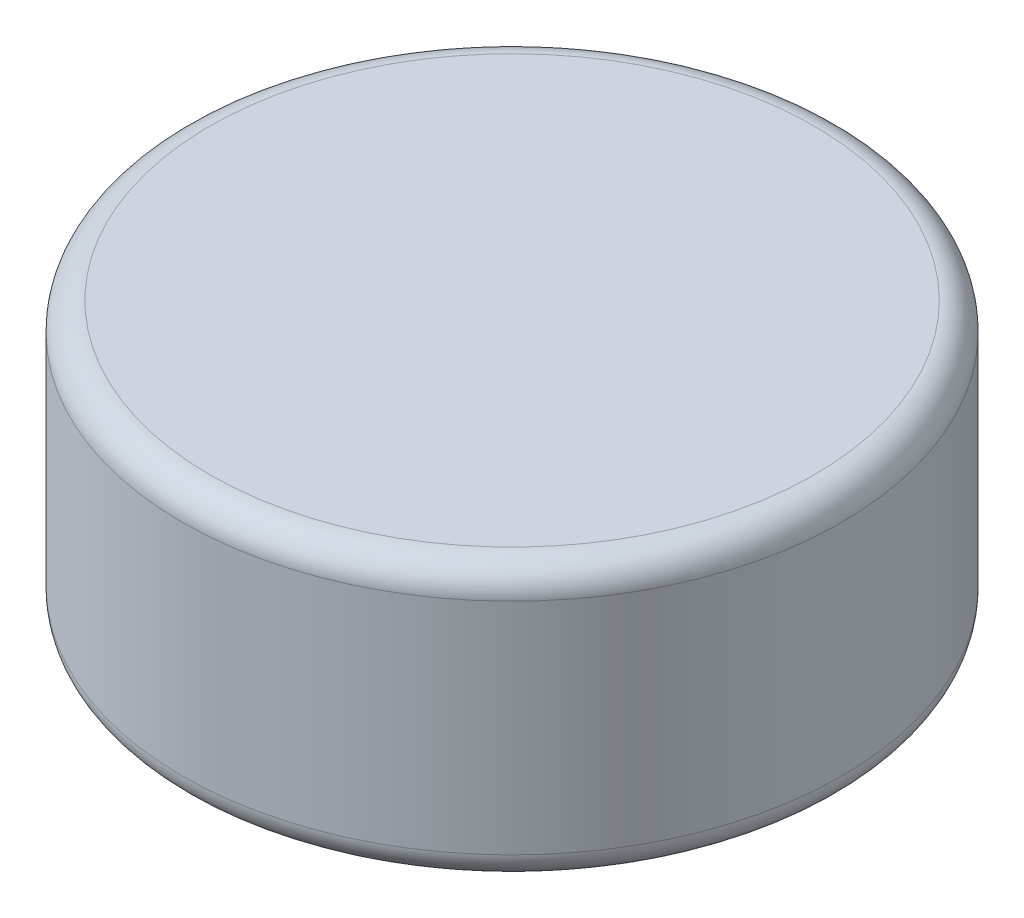
ISO-10303-21;
HEADER;
FILE_DESCRIPTION(('STEP AP214'),'2;1');
FILE_NAME('part.step','',(''),(''),'','','');
FILE_SCHEMA(('AUTOMOTIVE_DESIGN { 1 0 10303 214 1 1 1 1 }'));
ENDSEC;
DATA;
#1=APPLICATION_CONTEXT('core data for automotive mechanical design processes');
#2=APPLICATION_PROTOCOL_DEFINITION('international standard','automotive_design',2000,#1);
#3=PRODUCT_CONTEXT('',#1,'mechanical');
#4=PRODUCT('Part','Part','',(#3));
#5=PRODUCT_RELATED_PRODUCT_CATEGORY('part','',(#4));
#6=PRODUCT_DEFINITION_FORMATION('','',#4);
#7=PRODUCT_DEFINITION_CONTEXT('part definition',#1,'design');
#8=PRODUCT_DEFINITION('design','',#6,#7);
#9=PRODUCT_DEFINITION_SHAPE('','',#8);
#10=(LENGTH_UNIT() NAMED_UNIT(*) SI_UNIT(.MILLI.,.METRE.));
#11=(NAMED_UNIT(*) PLANE_ANGLE_UNIT() SI_UNIT($,.RADIAN.));
#12=(NAMED_UNIT(*) SI_UNIT($,.STERADIAN.) SOLID_ANGLE_UNIT());
#13=UNCERTAINTY_MEASURE_WITH_UNIT(LENGTH_MEASURE(1.E-05),#10,'distance_accuracy_value','');
#14=(GEOMETRIC_REPRESENTATION_CONTEXT(3) GLOBAL_UNCERTAINTY_ASSIGNED_CONTEXT((#13)) GLOBAL_UNIT_ASSIGNED_CONTEXT((#10,
#11,#12)) REPRESENTATION_CONTEXT('',''));
#15=CARTESIAN_POINT('',(0.,0.,0.));
#16=DIRECTION('',(0.,0.,1.));
#17=DIRECTION('',(1.,0.,0.));
#18=AXIS2_PLACEMENT_3D('',#15,#16,#17);
#19=CARTESIAN_POINT('',(0.,2.5,0.));
#20=DIRECTION('',(0.,-1.,0.));
#21=DIRECTION('',(0.,0.,-1.));
#22=AXIS2_PLACEMENT_3D('',#19,#20,#21);
#23=CYLINDRICAL_SURFACE('',#22,3.);
#24=CARTESIAN_POINT('',(0.,2.25,0.));
#25=DIRECTION('',(0.,1.,0.));
#26=DIRECTION('',(0.,0.,1.));
#27=AXIS2_PLACEMENT_3D('',#24,#25,#26);
#28=CIRCLE('',#27,3.);
#29=CARTESIAN_POINT('',(0.,2.25,3.));
#30=VERTEX_POINT('',#29);
#31=EDGE_CURVE('E38',#30,#30,#28,.F.);
#32=ORIENTED_EDGE('',*,*,#31,.T.);
#33=EDGE_LOOP('',(#32));
#34=FACE_BOUND('',#33,.T.);
#35=CARTESIAN_POINT('',(0.,0.25,0.));
#36=DIRECTION('',(0.,1.,0.));
#37=DIRECTION('',(0.,0.,1.));
#38=AXIS2_PLACEMENT_3D('',#35,#36,#37);
#39=CIRCLE('',#38,3.);
#40=CARTESIAN_POINT('',(0.,0.25,3.));
#41=VERTEX_POINT('',#40);
#42=EDGE_CURVE('E42',#41,#41,#39,.T.);
#43=ORIENTED_EDGE('',*,*,#42,.T.);
#44=EDGE_LOOP('',(#43));
#45=FACE_BOUND('',#44,.T.);
#46=ADVANCED_FACE('F31',(#34,#45),#23,.T.);
#47=CARTESIAN_POINT('',(0.,2.5,0.));
#48=DIRECTION('',(0.,1.,0.));
#49=DIRECTION('',(0.,0.,1.));
#50=AXIS2_PLACEMENT_3D('',#47,#48,#49);
#51=PLANE('',#50);
#52=CARTESIAN_POINT('',(0.,2.5,0.));
#53=DIRECTION('',(0.,1.,0.));
#54=DIRECTION('',(0.,0.,1.));
#55=AXIS2_PLACEMENT_3D('',#52,#53,#54);
#56=CIRCLE('',#55,2.75);
#57=CARTESIAN_POINT('',(0.,2.5,2.75));
#58=VERTEX_POINT('',#57);
#59=EDGE_CURVE('E46',#58,#58,#56,.T.);
#60=ORIENTED_EDGE('',*,*,#59,.T.);
#61=EDGE_LOOP('',(#60));
#62=FACE_BOUND('',#61,.T.);
#63=ADVANCED_FACE('F52',(#62),#51,.T.);
#64=CARTESIAN_POINT('',(0.,0.,0.));
#65=DIRECTION('',(0.,1.,0.));
#66=DIRECTION('',(0.,0.,1.));
#67=AXIS2_PLACEMENT_3D('',#64,#65,#66);
#68=PLANE('',#67);
#69=CARTESIAN_POINT('',(0.,0.,0.));
#70=DIRECTION('',(0.,1.,0.));
#71=DIRECTION('',(0.,0.,1.));
#72=AXIS2_PLACEMENT_3D('',#69,#70,#71);
#73=CIRCLE('',#72,2.75);
#74=CARTESIAN_POINT('',(0.,0.,2.75));
#75=VERTEX_POINT('',#74);
#76=EDGE_CURVE('E10',#75,#75,#73,.F.);
#77=ORIENTED_EDGE('',*,*,#76,.T.);
#78=EDGE_LOOP('',(#77));
#79=FACE_BOUND('',#78,.T.);
#80=ADVANCED_FACE('F56',(#79),#68,.F.);
#81=CARTESIAN_POINT('',(0.,2.25,0.));
#82=DIRECTION('',(0.,1.,0.));
#83=DIRECTION('',(0.,0.,1.));
#84=AXIS2_PLACEMENT_3D('',#81,#82,#83);
#85=TOROIDAL_SURFACE('',#84,2.75,0.25);
#86=ORIENTED_EDGE('',*,*,#31,.F.);
#87=EDGE_LOOP('',(#86));
#88=FACE_BOUND('',#87,.T.);
#89=ORIENTED_EDGE('',*,*,#59,.F.);
#90=EDGE_LOOP('',(#89));
#91=FACE_BOUND('',#90,.T.);
#92=ADVANCED_FACE('F54',(#88,#91),#85,.T.);
#93=CARTESIAN_POINT('',(0.,0.25,0.));
#94=DIRECTION('',(0.,1.,0.));
#95=DIRECTION('',(0.,0.,1.));
#96=AXIS2_PLACEMENT_3D('',#93,#94,#95);
#97=TOROIDAL_SURFACE('',#96,2.75,0.25);
#98=ORIENTED_EDGE('',*,*,#76,.F.);
#99=EDGE_LOOP('',(#98));
#100=FACE_BOUND('',#99,.T.);
#101=ORIENTED_EDGE('',*,*,#42,.F.);
#102=EDGE_LOOP('',(#101));
#103=FACE_BOUND('',#102,.T.);
#104=ADVANCED_FACE('F33',(#100,#103),#97,.T.);
#105=CLOSED_SHELL('',(#46,#63,#80,#92,#104));
#106=MANIFOLD_SOLID_BREP('B2',#105);
#107=ADVANCED_BREP_SHAPE_REPRESENTATION('',(#18,#106),#14);
#108=SHAPE_DEFINITION_REPRESENTATION(#9,#107);
ENDSEC;
END-ISO-10303-21;
